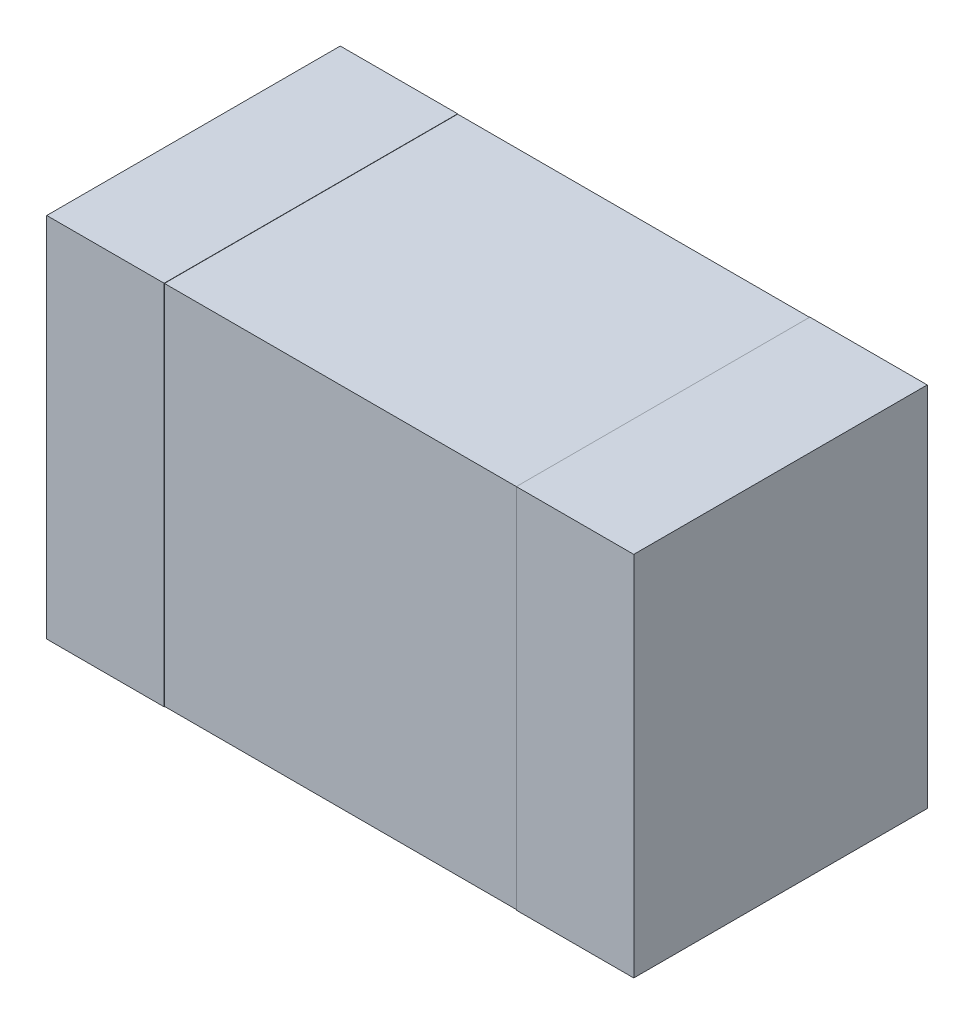
ISO-10303-21;
HEADER;
FILE_DESCRIPTION(('STEP AP214'),'2;1');
FILE_NAME('part.step','',(''),(''),'','','');
FILE_SCHEMA(('AUTOMOTIVE_DESIGN { 1 0 10303 214 1 1 1 1 }'));
ENDSEC;
DATA;
#1=APPLICATION_CONTEXT('core data for automotive mechanical design processes');
#2=APPLICATION_PROTOCOL_DEFINITION('international standard','automotive_design',2000,#1);
#3=PRODUCT_CONTEXT('',#1,'mechanical');
#4=PRODUCT('Part','Part','',(#3));
#5=PRODUCT_RELATED_PRODUCT_CATEGORY('part','',(#4));
#6=PRODUCT_DEFINITION_FORMATION('','',#4);
#7=PRODUCT_DEFINITION_CONTEXT('part definition',#1,'design');
#8=PRODUCT_DEFINITION('design','',#6,#7);
#9=PRODUCT_DEFINITION_SHAPE('','',#8);
#10=(LENGTH_UNIT() NAMED_UNIT(*) SI_UNIT(.MILLI.,.METRE.));
#11=(NAMED_UNIT(*) PLANE_ANGLE_UNIT() SI_UNIT($,.RADIAN.));
#12=(NAMED_UNIT(*) SI_UNIT($,.STERADIAN.) SOLID_ANGLE_UNIT());
#13=UNCERTAINTY_MEASURE_WITH_UNIT(LENGTH_MEASURE(1.E-05),#10,'distance_accuracy_value','');
#14=(GEOMETRIC_REPRESENTATION_CONTEXT(3) GLOBAL_UNCERTAINTY_ASSIGNED_CONTEXT((#13)) GLOBAL_UNIT_ASSIGNED_CONTEXT((#10,
#11,#12)) REPRESENTATION_CONTEXT('',''));
#15=CARTESIAN_POINT('',(0.,0.,0.));
#16=DIRECTION('',(0.,0.,1.));
#17=DIRECTION('',(1.,0.,0.));
#18=AXIS2_PLACEMENT_3D('',#15,#16,#17);
#19=CARTESIAN_POINT('',(0.6,-0.625,0.999));
#20=DIRECTION('',(0.,0.,-1.));
#21=DIRECTION('',(0.,-1.,0.));
#22=AXIS2_PLACEMENT_3D('',#19,#20,#21);
#23=PLANE('',#22);
#24=DIRECTION('',(0.,1.,0.));
#25=VECTOR('',#24,1.);
#26=CARTESIAN_POINT('',(0.6,-0.625,0.999));
#27=LINE('',#26,#25);
#28=CARTESIAN_POINT('',(0.6,-0.624,0.999));
#29=VERTEX_POINT('',#28);
#30=CARTESIAN_POINT('',(0.6,0.624,0.999));
#31=VERTEX_POINT('',#30);
#32=EDGE_CURVE('E218',#29,#31,#27,.T.);
#33=ORIENTED_EDGE('',*,*,#32,.T.);
#34=DIRECTION('',(-1.,0.,0.));
#35=VECTOR('',#34,1.);
#36=CARTESIAN_POINT('',(0.6,0.624,0.999));
#37=LINE('',#36,#35);
#38=CARTESIAN_POINT('',(-0.6,0.624,0.999));
#39=VERTEX_POINT('',#38);
#40=EDGE_CURVE('E142',#31,#39,#37,.T.);
#41=ORIENTED_EDGE('',*,*,#40,.T.);
#42=DIRECTION('',(0.,1.,0.));
#43=VECTOR('',#42,1.);
#44=CARTESIAN_POINT('',(-0.6,-0.625,0.999));
#45=LINE('',#44,#43);
#46=CARTESIAN_POINT('',(-0.6,-0.624,0.999));
#47=VERTEX_POINT('',#46);
#48=EDGE_CURVE('E141',#47,#39,#45,.T.);
#49=ORIENTED_EDGE('',*,*,#48,.F.);
#50=DIRECTION('',(-1.,0.,0.));
#51=VECTOR('',#50,1.);
#52=CARTESIAN_POINT('',(0.6,-0.624,0.999));
#53=LINE('',#52,#51);
#54=EDGE_CURVE('E11',#29,#47,#53,.T.);
#55=ORIENTED_EDGE('',*,*,#54,.F.);
#56=EDGE_LOOP('',(#33,#41,#49,#55));
#57=FACE_BOUND('',#56,.T.);
#58=ADVANCED_FACE('F16',(#57),#23,.F.);
#59=CARTESIAN_POINT('',(0.6,-0.624,1.));
#60=DIRECTION('',(0.,1.,0.));
#61=DIRECTION('',(1.,0.,0.));
#62=AXIS2_PLACEMENT_3D('',#59,#60,#61);
#63=PLANE('',#62);
#64=DIRECTION('',(0.,0.,-1.));
#65=VECTOR('',#64,1.);
#66=CARTESIAN_POINT('',(0.6,-0.624,1.));
#67=LINE('',#66,#65);
#68=CARTESIAN_POINT('',(0.6,-0.624,0.));
#69=VERTEX_POINT('',#68);
#70=EDGE_CURVE('E27',#29,#69,#67,.T.);
#71=ORIENTED_EDGE('',*,*,#70,.F.);
#72=ORIENTED_EDGE('',*,*,#54,.T.);
#73=DIRECTION('',(0.,0.,-1.));
#74=VECTOR('',#73,1.);
#75=CARTESIAN_POINT('',(-0.6,-0.624,1.));
#76=LINE('',#75,#74);
#77=CARTESIAN_POINT('',(-0.6,-0.624,0.));
#78=VERTEX_POINT('',#77);
#79=EDGE_CURVE('E137',#47,#78,#76,.T.);
#80=ORIENTED_EDGE('',*,*,#79,.T.);
#81=DIRECTION('',(1.,0.,0.));
#82=VECTOR('',#81,1.);
#83=CARTESIAN_POINT('',(0.6,-0.624,0.));
#84=LINE('',#83,#82);
#85=EDGE_CURVE('E202',#78,#69,#84,.T.);
#86=ORIENTED_EDGE('',*,*,#85,.T.);
#87=EDGE_LOOP('',(#71,#72,#80,#86));
#88=FACE_BOUND('',#87,.T.);
#89=ADVANCED_FACE('F134',(#88),#63,.F.);
#90=CARTESIAN_POINT('',(0.6,0.625,1.));
#91=DIRECTION('',(1.,0.,0.));
#92=DIRECTION('',(0.,1.,0.));
#93=AXIS2_PLACEMENT_3D('',#90,#91,#92);
#94=PLANE('',#93);
#95=DIRECTION('',(0.,-1.,0.));
#96=VECTOR('',#95,1.);
#97=CARTESIAN_POINT('',(0.6,0.625,0.));
#98=LINE('',#97,#96);
#99=CARTESIAN_POINT('',(0.6,0.625,0.));
#100=VERTEX_POINT('',#99);
#101=CARTESIAN_POINT('',(0.6,0.624,0.));
#102=VERTEX_POINT('',#101);
#103=EDGE_CURVE('E159',#100,#102,#98,.T.);
#104=ORIENTED_EDGE('',*,*,#103,.T.);
#105=DIRECTION('',(0.,0.,-1.));
#106=VECTOR('',#105,1.);
#107=CARTESIAN_POINT('',(0.6,0.624,1.));
#108=LINE('',#107,#106);
#109=EDGE_CURVE('E129',#31,#102,#108,.T.);
#110=ORIENTED_EDGE('',*,*,#109,.F.);
#111=ORIENTED_EDGE('',*,*,#32,.F.);
#112=ORIENTED_EDGE('',*,*,#70,.T.);
#113=DIRECTION('',(2.168404344971E-13,-1.,0.));
#114=VECTOR('',#113,1.);
#115=CARTESIAN_POINT('',(0.6,-0.624,0.));
#116=LINE('',#115,#114);
#117=CARTESIAN_POINT('',(0.6,-0.625,0.));
#118=VERTEX_POINT('',#117);
#119=EDGE_CURVE('E153',#69,#118,#116,.T.);
#120=ORIENTED_EDGE('',*,*,#119,.T.);
#121=DIRECTION('',(0.,0.,-1.));
#122=VECTOR('',#121,1.);
#123=CARTESIAN_POINT('',(0.6,-0.625,1.));
#124=LINE('',#123,#122);
#125=CARTESIAN_POINT('',(0.6,-0.625,1.));
#126=VERTEX_POINT('',#125);
#127=EDGE_CURVE('E185',#126,#118,#124,.T.);
#128=ORIENTED_EDGE('',*,*,#127,.F.);
#129=DIRECTION('',(0.,-1.,0.));
#130=VECTOR('',#129,1.);
#131=CARTESIAN_POINT('',(0.6,0.625,1.));
#132=LINE('',#131,#130);
#133=CARTESIAN_POINT('',(0.6,0.625,1.));
#134=VERTEX_POINT('',#133);
#135=EDGE_CURVE('E193',#134,#126,#132,.T.);
#136=ORIENTED_EDGE('',*,*,#135,.F.);
#137=DIRECTION('',(0.,0.,-1.));
#138=VECTOR('',#137,1.);
#139=CARTESIAN_POINT('',(0.6,0.625,1.));
#140=LINE('',#139,#138);
#141=EDGE_CURVE('E162',#134,#100,#140,.T.);
#142=ORIENTED_EDGE('',*,*,#141,.T.);
#143=EDGE_LOOP('',(#104,#110,#111,#112,#120,#128,#136,#142));
#144=FACE_BOUND('',#143,.T.);
#145=ADVANCED_FACE('F286',(#144),#94,.F.);
#146=CARTESIAN_POINT('',(0.6,0.624,1.));
#147=DIRECTION('',(0.,-1.,0.));
#148=DIRECTION('',(0.,0.,-1.));
#149=AXIS2_PLACEMENT_3D('',#146,#147,#148);
#150=PLANE('',#149);
#151=DIRECTION('',(0.,0.,-1.));
#152=VECTOR('',#151,1.);
#153=CARTESIAN_POINT('',(-0.6,0.624,1.));
#154=LINE('',#153,#152);
#155=CARTESIAN_POINT('',(-0.6,0.624,0.));
#156=VERTEX_POINT('',#155);
#157=EDGE_CURVE('E146',#39,#156,#154,.T.);
#158=ORIENTED_EDGE('',*,*,#157,.F.);
#159=ORIENTED_EDGE('',*,*,#40,.F.);
#160=ORIENTED_EDGE('',*,*,#109,.T.);
#161=DIRECTION('',(-1.,0.,0.));
#162=VECTOR('',#161,1.);
#163=CARTESIAN_POINT('',(0.6,0.624,0.));
#164=LINE('',#163,#162);
#165=EDGE_CURVE('E210',#102,#156,#164,.T.);
#166=ORIENTED_EDGE('',*,*,#165,.T.);
#167=EDGE_LOOP('',(#158,#159,#160,#166));
#168=FACE_BOUND('',#167,.T.);
#169=ADVANCED_FACE('F289',(#168),#150,.F.);
#170=CARTESIAN_POINT('',(-0.6,0.625,1.));
#171=DIRECTION('',(-1.,0.,0.));
#172=DIRECTION('',(0.,0.,1.));
#173=AXIS2_PLACEMENT_3D('',#170,#171,#172);
#174=PLANE('',#173);
#175=DIRECTION('',(0.,1.,0.));
#176=VECTOR('',#175,1.);
#177=CARTESIAN_POINT('',(-0.6,0.625,0.));
#178=LINE('',#177,#176);
#179=CARTESIAN_POINT('',(-0.6,0.625,0.));
#180=VERTEX_POINT('',#179);
#181=EDGE_CURVE('E201',#156,#180,#178,.T.);
#182=ORIENTED_EDGE('',*,*,#181,.T.);
#183=DIRECTION('',(0.,0.,-1.));
#184=VECTOR('',#183,1.);
#185=CARTESIAN_POINT('',(-0.6,0.625,1.));
#186=LINE('',#185,#184);
#187=CARTESIAN_POINT('',(-0.6,0.625,1.));
#188=VERTEX_POINT('',#187);
#189=EDGE_CURVE('E182',#188,#180,#186,.T.);
#190=ORIENTED_EDGE('',*,*,#189,.F.);
#191=DIRECTION('',(0.,1.,0.));
#192=VECTOR('',#191,1.);
#193=CARTESIAN_POINT('',(-0.6,0.625,1.));
#194=LINE('',#193,#192);
#195=CARTESIAN_POINT('',(-0.6,-0.625,1.));
#196=VERTEX_POINT('',#195);
#197=EDGE_CURVE('E219',#196,#188,#194,.T.);
#198=ORIENTED_EDGE('',*,*,#197,.F.);
#199=DIRECTION('',(0.,0.,-1.));
#200=VECTOR('',#199,1.);
#201=CARTESIAN_POINT('',(-0.6,-0.625,1.));
#202=LINE('',#201,#200);
#203=CARTESIAN_POINT('',(-0.6,-0.625,0.));
#204=VERTEX_POINT('',#203);
#205=EDGE_CURVE('E183',#196,#204,#202,.T.);
#206=ORIENTED_EDGE('',*,*,#205,.T.);
#207=DIRECTION('',(-2.168404344971E-13,1.,0.));
#208=VECTOR('',#207,1.);
#209=CARTESIAN_POINT('',(-0.6,-0.624,0.));
#210=LINE('',#209,#208);
#211=EDGE_CURVE('E150',#204,#78,#210,.T.);
#212=ORIENTED_EDGE('',*,*,#211,.T.);
#213=ORIENTED_EDGE('',*,*,#79,.F.);
#214=ORIENTED_EDGE('',*,*,#48,.T.);
#215=ORIENTED_EDGE('',*,*,#157,.T.);
#216=EDGE_LOOP('',(#182,#190,#198,#206,#212,#213,#214,#215));
#217=FACE_BOUND('',#216,.T.);
#218=ADVANCED_FACE('F148',(#217),#174,.F.);
#219=CARTESIAN_POINT('',(0.,0.,0.));
#220=DIRECTION('',(0.,0.,1.));
#221=DIRECTION('',(1.,0.,0.));
#222=AXIS2_PLACEMENT_3D('',#219,#220,#221);
#223=PLANE('',#222);
#224=ORIENTED_EDGE('',*,*,#85,.F.);
#225=ORIENTED_EDGE('',*,*,#211,.F.);
#226=DIRECTION('',(1.,0.,0.));
#227=VECTOR('',#226,1.);
#228=CARTESIAN_POINT('',(-1.,-0.625,0.));
#229=LINE('',#228,#227);
#230=CARTESIAN_POINT('',(-1.,-0.625,0.));
#231=VERTEX_POINT('',#230);
#232=EDGE_CURVE('E203',#231,#204,#229,.T.);
#233=ORIENTED_EDGE('',*,*,#232,.F.);
#234=DIRECTION('',(0.,-1.,0.));
#235=VECTOR('',#234,1.);
#236=CARTESIAN_POINT('',(-1.,0.625,0.));
#237=LINE('',#236,#235);
#238=CARTESIAN_POINT('',(-1.,0.625,0.));
#239=VERTEX_POINT('',#238);
#240=EDGE_CURVE('E194',#239,#231,#237,.T.);
#241=ORIENTED_EDGE('',*,*,#240,.F.);
#242=DIRECTION('',(-1.,0.,0.));
#243=VECTOR('',#242,1.);
#244=CARTESIAN_POINT('',(-1.,0.625,0.));
#245=LINE('',#244,#243);
#246=EDGE_CURVE('E178',#180,#239,#245,.T.);
#247=ORIENTED_EDGE('',*,*,#246,.F.);
#248=ORIENTED_EDGE('',*,*,#181,.F.);
#249=ORIENTED_EDGE('',*,*,#165,.F.);
#250=ORIENTED_EDGE('',*,*,#103,.F.);
#251=DIRECTION('',(-1.,0.,0.));
#252=VECTOR('',#251,1.);
#253=CARTESIAN_POINT('',(-1.,0.625,0.));
#254=LINE('',#253,#252);
#255=CARTESIAN_POINT('',(1.,0.625,0.));
#256=VERTEX_POINT('',#255);
#257=EDGE_CURVE('E167',#256,#100,#254,.T.);
#258=ORIENTED_EDGE('',*,*,#257,.F.);
#259=DIRECTION('',(0.,1.,0.));
#260=VECTOR('',#259,1.);
#261=CARTESIAN_POINT('',(1.,0.625,0.));
#262=LINE('',#261,#260);
#263=CARTESIAN_POINT('',(1.,-0.625,0.));
#264=VERTEX_POINT('',#263);
#265=EDGE_CURVE('E177',#264,#256,#262,.T.);
#266=ORIENTED_EDGE('',*,*,#265,.F.);
#267=DIRECTION('',(1.,0.,0.));
#268=VECTOR('',#267,1.);
#269=CARTESIAN_POINT('',(-1.,-0.625,0.));
#270=LINE('',#269,#268);
#271=EDGE_CURVE('E189',#118,#264,#270,.T.);
#272=ORIENTED_EDGE('',*,*,#271,.F.);
#273=ORIENTED_EDGE('',*,*,#119,.F.);
#274=EDGE_LOOP('',(#224,#225,#233,#241,#247,#248,#249,#250,#258,#266,#272,#273));
#275=FACE_BOUND('',#274,.T.);
#276=ADVANCED_FACE('F280',(#275),#223,.F.);
#277=CARTESIAN_POINT('',(0.,0.,1.));
#278=DIRECTION('',(0.,0.,1.));
#279=DIRECTION('',(1.,0.,0.));
#280=AXIS2_PLACEMENT_3D('',#277,#278,#279);
#281=PLANE('',#280);
#282=ORIENTED_EDGE('',*,*,#135,.T.);
#283=DIRECTION('',(1.,0.,0.));
#284=VECTOR('',#283,1.);
#285=CARTESIAN_POINT('',(-1.,-0.625,1.));
#286=LINE('',#285,#284);
#287=CARTESIAN_POINT('',(1.,-0.625,1.));
#288=VERTEX_POINT('',#287);
#289=EDGE_CURVE('E190',#126,#288,#286,.T.);
#290=ORIENTED_EDGE('',*,*,#289,.T.);
#291=DIRECTION('',(0.,1.,0.));
#292=VECTOR('',#291,1.);
#293=CARTESIAN_POINT('',(1.,0.625,1.));
#294=LINE('',#293,#292);
#295=CARTESIAN_POINT('',(1.,0.625,1.));
#296=VERTEX_POINT('',#295);
#297=EDGE_CURVE('E168',#288,#296,#294,.T.);
#298=ORIENTED_EDGE('',*,*,#297,.T.);
#299=DIRECTION('',(-1.,0.,0.));
#300=VECTOR('',#299,1.);
#301=CARTESIAN_POINT('',(-1.,0.625,1.));
#302=LINE('',#301,#300);
#303=EDGE_CURVE('E166',#296,#134,#302,.T.);
#304=ORIENTED_EDGE('',*,*,#303,.T.);
#305=EDGE_LOOP('',(#282,#290,#298,#304));
#306=FACE_BOUND('',#305,.T.);
#307=ADVANCED_FACE('F438',(#306),#281,.T.);
#308=CARTESIAN_POINT('',(-1.,-0.625,1.));
#309=DIRECTION('',(0.,1.,0.));
#310=DIRECTION('',(1.,0.,0.));
#311=AXIS2_PLACEMENT_3D('',#308,#309,#310);
#312=PLANE('',#311);
#313=ORIENTED_EDGE('',*,*,#289,.F.);
#314=ORIENTED_EDGE('',*,*,#127,.T.);
#315=ORIENTED_EDGE('',*,*,#271,.T.);
#316=DIRECTION('',(0.,0.,-1.));
#317=VECTOR('',#316,1.);
#318=CARTESIAN_POINT('',(1.,-0.625,1.));
#319=LINE('',#318,#317);
#320=EDGE_CURVE('E20',#288,#264,#319,.T.);
#321=ORIENTED_EDGE('',*,*,#320,.F.);
#322=EDGE_LOOP('',(#313,#314,#315,#321));
#323=FACE_BOUND('',#322,.T.);
#324=ADVANCED_FACE('F414',(#323),#312,.F.);
#325=CARTESIAN_POINT('',(-1.,0.625,1.));
#326=DIRECTION('',(1.,0.,0.));
#327=DIRECTION('',(0.,1.,0.));
#328=AXIS2_PLACEMENT_3D('',#325,#326,#327);
#329=PLANE('',#328);
#330=ORIENTED_EDGE('',*,*,#240,.T.);
#331=DIRECTION('',(0.,0.,-1.));
#332=VECTOR('',#331,1.);
#333=CARTESIAN_POINT('',(-1.,-0.625,1.));
#334=LINE('',#333,#332);
#335=CARTESIAN_POINT('',(-1.,-0.625,1.));
#336=VERTEX_POINT('',#335);
#337=EDGE_CURVE('E179',#336,#231,#334,.T.);
#338=ORIENTED_EDGE('',*,*,#337,.F.);
#339=DIRECTION('',(0.,-1.,0.));
#340=VECTOR('',#339,1.);
#341=CARTESIAN_POINT('',(-1.,0.625,1.));
#342=LINE('',#341,#340);
#343=CARTESIAN_POINT('',(-1.,0.625,1.));
#344=VERTEX_POINT('',#343);
#345=EDGE_CURVE('E207',#344,#336,#342,.T.);
#346=ORIENTED_EDGE('',*,*,#345,.F.);
#347=DIRECTION('',(0.,0.,-1.));
#348=VECTOR('',#347,1.);
#349=CARTESIAN_POINT('',(-1.,0.625,1.));
#350=LINE('',#349,#348);
#351=EDGE_CURVE('E173',#344,#239,#350,.T.);
#352=ORIENTED_EDGE('',*,*,#351,.T.);
#353=EDGE_LOOP('',(#330,#338,#346,#352));
#354=FACE_BOUND('',#353,.T.);
#355=ADVANCED_FACE('F18',(#354),#329,.F.);
#356=CARTESIAN_POINT('',(-1.,0.625,1.));
#357=DIRECTION('',(0.,-1.,0.));
#358=DIRECTION('',(0.,0.,-1.));
#359=AXIS2_PLACEMENT_3D('',#356,#357,#358);
#360=PLANE('',#359);
#361=ORIENTED_EDGE('',*,*,#257,.T.);
#362=ORIENTED_EDGE('',*,*,#141,.F.);
#363=ORIENTED_EDGE('',*,*,#303,.F.);
#364=DIRECTION('',(0.,0.,-1.));
#365=VECTOR('',#364,1.);
#366=CARTESIAN_POINT('',(1.,0.625,1.));
#367=LINE('',#366,#365);
#368=EDGE_CURVE('E172',#296,#256,#367,.T.);
#369=ORIENTED_EDGE('',*,*,#368,.T.);
#370=EDGE_LOOP('',(#361,#362,#363,#369));
#371=FACE_BOUND('',#370,.T.);
#372=ADVANCED_FACE('F293',(#371),#360,.F.);
#373=CARTESIAN_POINT('',(1.,0.625,1.));
#374=DIRECTION('',(-1.,0.,0.));
#375=DIRECTION('',(0.,0.,1.));
#376=AXIS2_PLACEMENT_3D('',#373,#374,#375);
#377=PLANE('',#376);
#378=ORIENTED_EDGE('',*,*,#265,.T.);
#379=ORIENTED_EDGE('',*,*,#368,.F.);
#380=ORIENTED_EDGE('',*,*,#297,.F.);
#381=ORIENTED_EDGE('',*,*,#320,.T.);
#382=EDGE_LOOP('',(#378,#379,#380,#381));
#383=FACE_BOUND('',#382,.T.);
#384=ADVANCED_FACE('F298',(#383),#377,.F.);
#385=CARTESIAN_POINT('',(-1.,0.625,1.));
#386=DIRECTION('',(0.,-1.,0.));
#387=DIRECTION('',(0.,0.,-1.));
#388=AXIS2_PLACEMENT_3D('',#385,#386,#387);
#389=PLANE('',#388);
#390=DIRECTION('',(-1.,0.,0.));
#391=VECTOR('',#390,1.);
#392=CARTESIAN_POINT('',(-1.,0.625,1.));
#393=LINE('',#392,#391);
#394=EDGE_CURVE('E223',#188,#344,#393,.T.);
#395=ORIENTED_EDGE('',*,*,#394,.F.);
#396=ORIENTED_EDGE('',*,*,#189,.T.);
#397=ORIENTED_EDGE('',*,*,#246,.T.);
#398=ORIENTED_EDGE('',*,*,#351,.F.);
#399=EDGE_LOOP('',(#395,#396,#397,#398));
#400=FACE_BOUND('',#399,.T.);
#401=ADVANCED_FACE('F278',(#400),#389,.F.);
#402=CARTESIAN_POINT('',(-1.,-0.625,1.));
#403=DIRECTION('',(0.,1.,0.));
#404=DIRECTION('',(1.,0.,0.));
#405=AXIS2_PLACEMENT_3D('',#402,#403,#404);
#406=PLANE('',#405);
#407=ORIENTED_EDGE('',*,*,#232,.T.);
#408=ORIENTED_EDGE('',*,*,#205,.F.);
#409=DIRECTION('',(1.,0.,0.));
#410=VECTOR('',#409,1.);
#411=CARTESIAN_POINT('',(-1.,-0.625,1.));
#412=LINE('',#411,#410);
#413=EDGE_CURVE('E224',#336,#196,#412,.T.);
#414=ORIENTED_EDGE('',*,*,#413,.F.);
#415=ORIENTED_EDGE('',*,*,#337,.T.);
#416=EDGE_LOOP('',(#407,#408,#414,#415));
#417=FACE_BOUND('',#416,.T.);
#418=ADVANCED_FACE('F272',(#417),#406,.F.);
#419=CARTESIAN_POINT('',(0.,0.,1.));
#420=DIRECTION('',(0.,0.,1.));
#421=DIRECTION('',(1.,0.,0.));
#422=AXIS2_PLACEMENT_3D('',#419,#420,#421);
#423=PLANE('',#422);
#424=ORIENTED_EDGE('',*,*,#413,.T.);
#425=ORIENTED_EDGE('',*,*,#197,.T.);
#426=ORIENTED_EDGE('',*,*,#394,.T.);
#427=ORIENTED_EDGE('',*,*,#345,.T.);
#428=EDGE_LOOP('',(#424,#425,#426,#427));
#429=FACE_BOUND('',#428,.T.);
#430=ADVANCED_FACE('F268',(#429),#423,.T.);
#431=CLOSED_SHELL('',(#58,#89,#145,#169,#218,#276,#307,#324,#355,#372,#384,#401,#418,#430));
#432=MANIFOLD_SOLID_BREP('B1',#431);
#433=ADVANCED_BREP_SHAPE_REPRESENTATION('',(#18,#432),#14);
#434=SHAPE_DEFINITION_REPRESENTATION(#9,#433);
ENDSEC;
END-ISO-10303-21;
